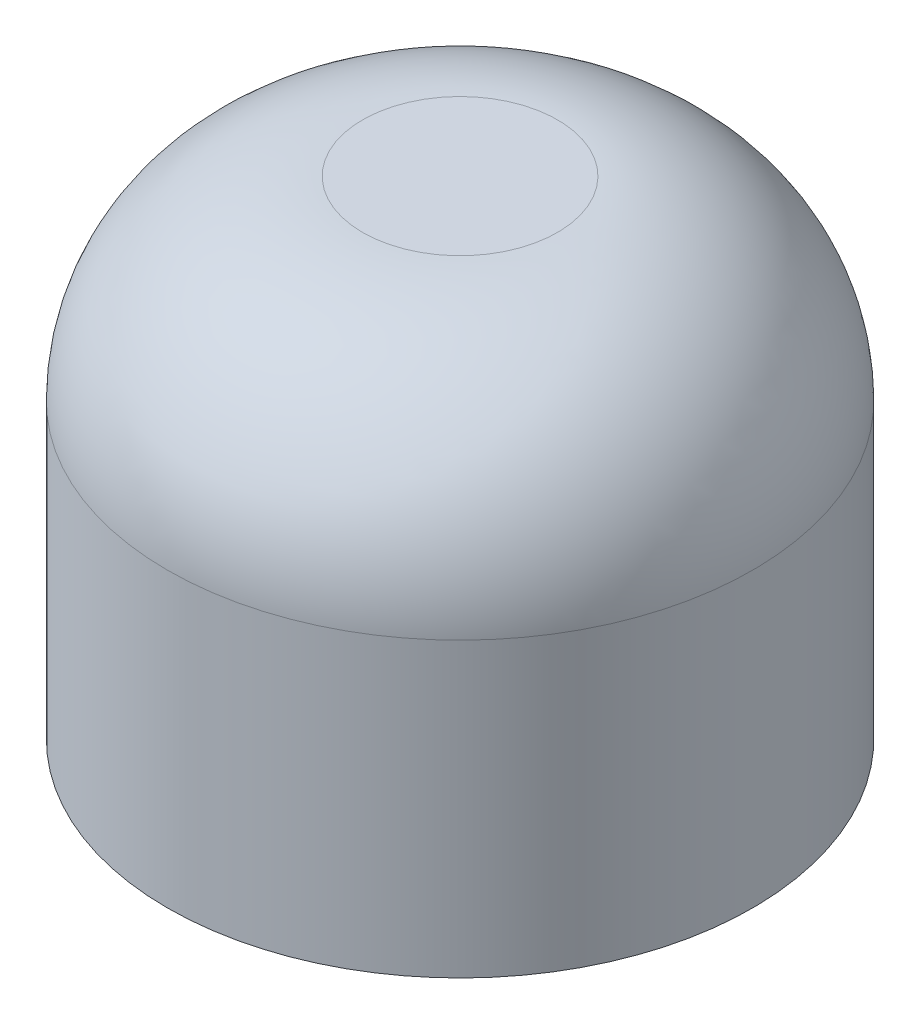
ISO-10303-21;
HEADER;
FILE_DESCRIPTION(('STEP AP214'),'2;1');
FILE_NAME('part.step','',(''),(''),'','','');
FILE_SCHEMA(('AUTOMOTIVE_DESIGN { 1 0 10303 214 1 1 1 1 }'));
ENDSEC;
DATA;
#1=APPLICATION_CONTEXT('core data for automotive mechanical design processes');
#2=APPLICATION_PROTOCOL_DEFINITION('international standard','automotive_design',2000,#1);
#3=PRODUCT_CONTEXT('',#1,'mechanical');
#4=PRODUCT('Part','Part','',(#3));
#5=PRODUCT_RELATED_PRODUCT_CATEGORY('part','',(#4));
#6=PRODUCT_DEFINITION_FORMATION('','',#4);
#7=PRODUCT_DEFINITION_CONTEXT('part definition',#1,'design');
#8=PRODUCT_DEFINITION('design','',#6,#7);
#9=PRODUCT_DEFINITION_SHAPE('','',#8);
#10=(LENGTH_UNIT() NAMED_UNIT(*) SI_UNIT(.MILLI.,.METRE.));
#11=(NAMED_UNIT(*) PLANE_ANGLE_UNIT() SI_UNIT($,.RADIAN.));
#12=(NAMED_UNIT(*) SI_UNIT($,.STERADIAN.) SOLID_ANGLE_UNIT());
#13=UNCERTAINTY_MEASURE_WITH_UNIT(LENGTH_MEASURE(1.E-05),#10,'distance_accuracy_value','');
#14=(GEOMETRIC_REPRESENTATION_CONTEXT(3) GLOBAL_UNCERTAINTY_ASSIGNED_CONTEXT((#13)) GLOBAL_UNIT_ASSIGNED_CONTEXT((#10,
#11,#12)) REPRESENTATION_CONTEXT('',''));
#15=CARTESIAN_POINT('',(0.,0.,0.));
#16=DIRECTION('',(0.,0.,1.));
#17=DIRECTION('',(1.,0.,0.));
#18=AXIS2_PLACEMENT_3D('',#15,#16,#17);
#19=CARTESIAN_POINT('',(0.,5.,0.));
#20=DIRECTION('',(0.,-1.,0.));
#21=DIRECTION('',(0.,0.,-1.));
#22=AXIS2_PLACEMENT_3D('',#19,#20,#21);
#23=CYLINDRICAL_SURFACE('',#22,3.);
#24=CARTESIAN_POINT('',(0.,3.,0.));
#25=DIRECTION('',(0.,1.,0.));
#26=DIRECTION('',(0.,0.,1.));
#27=AXIS2_PLACEMENT_3D('',#24,#25,#26);
#28=CIRCLE('',#27,3.);
#29=CARTESIAN_POINT('',(0.,3.,3.));
#30=VERTEX_POINT('',#29);
#31=EDGE_CURVE('E10',#30,#30,#28,.F.);
#32=ORIENTED_EDGE('',*,*,#31,.T.);
#33=EDGE_LOOP('',(#32));
#34=FACE_BOUND('',#33,.T.);
#35=CARTESIAN_POINT('',(0.,0.,0.));
#36=DIRECTION('',(0.,1.,0.));
#37=DIRECTION('',(0.,0.,1.));
#38=AXIS2_PLACEMENT_3D('',#35,#36,#37);
#39=CIRCLE('',#38,3.);
#40=CARTESIAN_POINT('',(0.,0.,3.));
#41=VERTEX_POINT('',#40);
#42=EDGE_CURVE('E50',#41,#41,#39,.T.);
#43=ORIENTED_EDGE('',*,*,#42,.T.);
#44=EDGE_LOOP('',(#43));
#45=FACE_BOUND('',#44,.T.);
#46=ADVANCED_FACE('F39',(#34,#45),#23,.T.);
#47=CARTESIAN_POINT('',(0.,5.,0.));
#48=DIRECTION('',(0.,1.,0.));
#49=DIRECTION('',(0.,0.,1.));
#50=AXIS2_PLACEMENT_3D('',#47,#48,#49);
#51=PLANE('',#50);
#52=CARTESIAN_POINT('',(0.,5.,0.));
#53=DIRECTION('',(0.,1.,0.));
#54=DIRECTION('',(0.,0.,1.));
#55=AXIS2_PLACEMENT_3D('',#52,#53,#54);
#56=CIRCLE('',#55,1.);
#57=CARTESIAN_POINT('',(0.,5.,1.));
#58=VERTEX_POINT('',#57);
#59=EDGE_CURVE('E46',#58,#58,#56,.T.);
#60=ORIENTED_EDGE('',*,*,#59,.T.);
#61=EDGE_LOOP('',(#60));
#62=FACE_BOUND('',#61,.T.);
#63=ADVANCED_FACE('F60',(#62),#51,.T.);
#64=CARTESIAN_POINT('',(0.,0.,0.));
#65=DIRECTION('',(0.,1.,0.));
#66=DIRECTION('',(0.,0.,1.));
#67=AXIS2_PLACEMENT_3D('',#64,#65,#66);
#68=PLANE('',#67);
#69=ORIENTED_EDGE('',*,*,#42,.F.);
#70=EDGE_LOOP('',(#69));
#71=FACE_BOUND('',#70,.T.);
#72=ADVANCED_FACE('F58',(#71),#68,.F.);
#73=CARTESIAN_POINT('',(0.,3.,0.));
#74=DIRECTION('',(0.,1.,0.));
#75=DIRECTION('',(0.,0.,1.));
#76=AXIS2_PLACEMENT_3D('',#73,#74,#75);
#77=DEGENERATE_TOROIDAL_SURFACE('',#76,1.,2.,.T.);
#78=ORIENTED_EDGE('',*,*,#31,.F.);
#79=EDGE_LOOP('',(#78));
#80=FACE_BOUND('',#79,.T.);
#81=ORIENTED_EDGE('',*,*,#59,.F.);
#82=EDGE_LOOP('',(#81));
#83=FACE_BOUND('',#82,.T.);
#84=ADVANCED_FACE('F41',(#80,#83),#77,.T.);
#85=CLOSED_SHELL('',(#46,#63,#72,#84));
#86=MANIFOLD_SOLID_BREP('B2',#85);
#87=ADVANCED_BREP_SHAPE_REPRESENTATION('',(#18,#86),#14);
#88=SHAPE_DEFINITION_REPRESENTATION(#9,#87);
ENDSEC;
END-ISO-10303-21;
